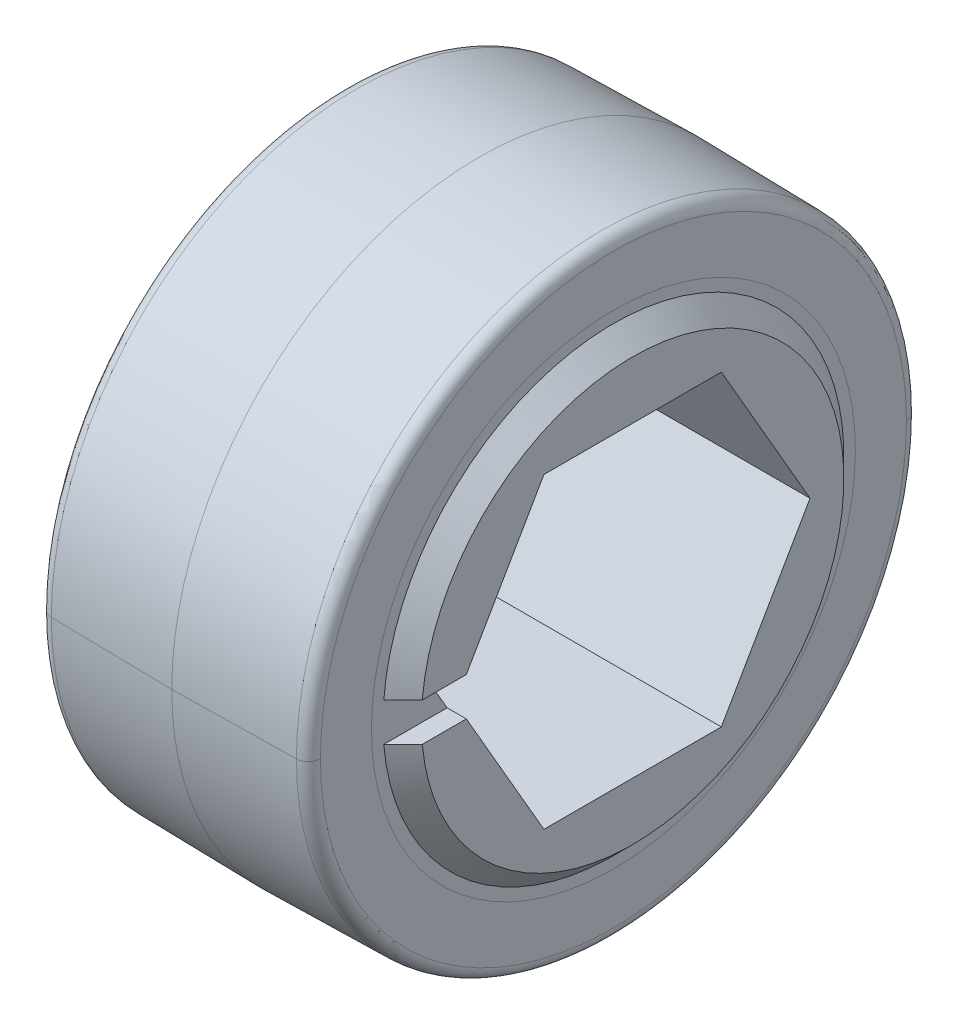
ISO-10303-21;
HEADER;
FILE_DESCRIPTION(('STEP AP214'),'2;1');
FILE_NAME('part.step','',(''),(''),'','','');
FILE_SCHEMA(('AUTOMOTIVE_DESIGN { 1 0 10303 214 1 1 1 1 }'));
ENDSEC;
DATA;
#1=APPLICATION_CONTEXT('core data for automotive mechanical design processes');
#2=APPLICATION_PROTOCOL_DEFINITION('international standard','automotive_design',2000,#1);
#3=PRODUCT_CONTEXT('',#1,'mechanical');
#4=PRODUCT('Part','Part','',(#3));
#5=PRODUCT_RELATED_PRODUCT_CATEGORY('part','',(#4));
#6=PRODUCT_DEFINITION_FORMATION('','',#4);
#7=PRODUCT_DEFINITION_CONTEXT('part definition',#1,'design');
#8=PRODUCT_DEFINITION('design','',#6,#7);
#9=PRODUCT_DEFINITION_SHAPE('','',#8);
#10=(LENGTH_UNIT() NAMED_UNIT(*) SI_UNIT(.MILLI.,.METRE.));
#11=(NAMED_UNIT(*) PLANE_ANGLE_UNIT() SI_UNIT($,.RADIAN.));
#12=(NAMED_UNIT(*) SI_UNIT($,.STERADIAN.) SOLID_ANGLE_UNIT());
#13=UNCERTAINTY_MEASURE_WITH_UNIT(LENGTH_MEASURE(1.E-05),#10,'distance_accuracy_value','');
#14=(GEOMETRIC_REPRESENTATION_CONTEXT(3) GLOBAL_UNCERTAINTY_ASSIGNED_CONTEXT((#13)) GLOBAL_UNIT_ASSIGNED_CONTEXT((#10,
#11,#12)) REPRESENTATION_CONTEXT('',''));
#15=CARTESIAN_POINT('',(0.,0.,0.));
#16=DIRECTION('',(0.,0.,1.));
#17=DIRECTION('',(1.,0.,0.));
#18=AXIS2_PLACEMENT_3D('',#15,#16,#17);
#19=CARTESIAN_POINT('',(-5.55625,0.,0.));
#20=DIRECTION('',(1.,0.,0.));
#21=DIRECTION('',(0.,1.,0.));
#22=AXIS2_PLACEMENT_3D('',#19,#20,#21);
#23=PLANE('',#22);
#24=CARTESIAN_POINT('',(-5.55625,0.,0.));
#25=DIRECTION('',(1.,0.,0.));
#26=DIRECTION('',(0.,0.,-1.));
#27=AXIS2_PLACEMENT_3D('',#24,#25,#26);
#28=CIRCLE('',#27,10.);
#29=CARTESIAN_POINT('',(-5.55625,0.,10.));
#30=VERTEX_POINT('',#29);
#31=CARTESIAN_POINT('',(-5.55625,0.,-10.));
#32=VERTEX_POINT('',#31);
#33=EDGE_CURVE('P0_E178',#30,#32,#28,.T.);
#34=ORIENTED_EDGE('',*,*,#33,.T.);
#35=CARTESIAN_POINT('',(-5.55625,0.,0.));
#36=DIRECTION('',(1.,0.,0.));
#37=DIRECTION('',(0.,0.,-1.));
#38=AXIS2_PLACEMENT_3D('',#35,#36,#37);
#39=CIRCLE('',#38,10.);
#40=EDGE_CURVE('P0_E37',#32,#30,#39,.T.);
#41=ORIENTED_EDGE('',*,*,#40,.T.);
#42=EDGE_LOOP('',(#34,#41));
#43=FACE_BOUND('',#42,.T.);
#44=CARTESIAN_POINT('',(-5.55625,0.,0.));
#45=DIRECTION('',(-1.,0.,0.));
#46=DIRECTION('',(0.,0.,-1.));
#47=AXIS2_PLACEMENT_3D('',#44,#45,#46);
#48=CIRCLE('',#47,12.1116666482116);
#49=CARTESIAN_POINT('',(-5.55625,0.,-12.1116666482116));
#50=VERTEX_POINT('',#49);
#51=CARTESIAN_POINT('',(-5.55625,0.,12.1116666482116));
#52=VERTEX_POINT('',#51);
#53=EDGE_CURVE('P0_E143',#50,#52,#48,.T.);
#54=ORIENTED_EDGE('',*,*,#53,.T.);
#55=CARTESIAN_POINT('',(-5.55625,0.,0.));
#56=DIRECTION('',(-1.,0.,0.));
#57=DIRECTION('',(0.,0.,-1.));
#58=AXIS2_PLACEMENT_3D('',#55,#56,#57);
#59=CIRCLE('',#58,12.1116666482116);
#60=EDGE_CURVE('P0_E140',#52,#50,#59,.T.);
#61=ORIENTED_EDGE('',*,*,#60,.T.);
#62=EDGE_LOOP('',(#54,#61));
#63=FACE_BOUND('',#62,.T.);
#64=ADVANCED_FACE('P0_F16',(#43,#63),#23,.F.);
#65=CARTESIAN_POINT('',(5.55625,0.,0.));
#66=DIRECTION('',(1.,0.,0.));
#67=DIRECTION('',(0.,1.,0.));
#68=AXIS2_PLACEMENT_3D('',#65,#66,#67);
#69=PLANE('',#68);
#70=CARTESIAN_POINT('',(5.55625,0.,0.));
#71=DIRECTION('',(1.,0.,0.));
#72=DIRECTION('',(0.,0.,-1.));
#73=AXIS2_PLACEMENT_3D('',#70,#71,#72);
#74=CIRCLE('',#73,10.);
#75=CARTESIAN_POINT('',(5.55625,0.,10.));
#76=VERTEX_POINT('',#75);
#77=CARTESIAN_POINT('',(5.55625,0.,-10.));
#78=VERTEX_POINT('',#77);
#79=EDGE_CURVE('P0_E173',#76,#78,#74,.T.);
#80=ORIENTED_EDGE('',*,*,#79,.F.);
#81=CARTESIAN_POINT('',(5.55625,0.,0.));
#82=DIRECTION('',(1.,0.,0.));
#83=DIRECTION('',(0.,0.,-1.));
#84=AXIS2_PLACEMENT_3D('',#81,#82,#83);
#85=CIRCLE('',#84,10.);
#86=EDGE_CURVE('P0_E135',#78,#76,#85,.T.);
#87=ORIENTED_EDGE('',*,*,#86,.F.);
#88=EDGE_LOOP('',(#80,#87));
#89=FACE_BOUND('',#88,.T.);
#90=CARTESIAN_POINT('',(5.55625,0.,0.));
#91=DIRECTION('',(1.,0.,0.));
#92=DIRECTION('',(0.,0.,-1.));
#93=AXIS2_PLACEMENT_3D('',#90,#91,#92);
#94=CIRCLE('',#93,12.1116666482116);
#95=CARTESIAN_POINT('',(5.55625,0.,-12.1116666482116));
#96=VERTEX_POINT('',#95);
#97=CARTESIAN_POINT('',(5.55625,0.,12.1116666482116));
#98=VERTEX_POINT('',#97);
#99=EDGE_CURVE('P0_E133',#96,#98,#94,.T.);
#100=ORIENTED_EDGE('',*,*,#99,.T.);
#101=CARTESIAN_POINT('',(5.55625,0.,0.));
#102=DIRECTION('',(1.,0.,0.));
#103=DIRECTION('',(0.,0.,-1.));
#104=AXIS2_PLACEMENT_3D('',#101,#102,#103);
#105=CIRCLE('',#104,12.1116666482116);
#106=EDGE_CURVE('P0_E26',#98,#96,#105,.T.);
#107=ORIENTED_EDGE('',*,*,#106,.T.);
#108=EDGE_LOOP('',(#100,#107));
#109=FACE_BOUND('',#108,.T.);
#110=ADVANCED_FACE('P0_F196',(#89,#109),#69,.T.);
#111=CARTESIAN_POINT('',(0.,0.,0.));
#112=DIRECTION('',(1.,0.,0.));
#113=DIRECTION('',(0.,0.,-1.));
#114=AXIS2_PLACEMENT_3D('',#111,#112,#113);
#115=CONICAL_SURFACE('',#114,12.7,0.0174532925199352);
#116=DIRECTION('',(0.999847695156391,0.,0.0174524064372769));
#117=VECTOR('',#116,1.);
#118=CARTESIAN_POINT('',(0.,0.,12.7));
#119=LINE('',#118,#117);
#120=CARTESIAN_POINT('',(-5.06497618749779,0.,12.6115905117874));
#121=VERTEX_POINT('',#120);
#122=CARTESIAN_POINT('',(0.,0.,12.7));
#123=VERTEX_POINT('',#122);
#124=EDGE_CURVE('P0_E94',#121,#123,#119,.T.);
#125=ORIENTED_EDGE('',*,*,#124,.F.);
#126=CARTESIAN_POINT('',(-5.06497618749779,0.,0.));
#127=DIRECTION('',(1.,0.,0.));
#128=DIRECTION('',(0.,0.,1.));
#129=AXIS2_PLACEMENT_3D('',#126,#127,#128);
#130=CIRCLE('',#129,12.6115905117874);
#131=CARTESIAN_POINT('',(-5.06497618749779,0.,-12.6115905117874));
#132=VERTEX_POINT('',#131);
#133=EDGE_CURVE('P0_E150',#121,#132,#130,.T.);
#134=ORIENTED_EDGE('',*,*,#133,.T.);
#135=DIRECTION('',(0.999847695156391,0.,-0.0174524064372769));
#136=VECTOR('',#135,1.);
#137=CARTESIAN_POINT('',(0.,0.,-12.7));
#138=LINE('',#137,#136);
#139=CARTESIAN_POINT('',(0.,0.,-12.7));
#140=VERTEX_POINT('',#139);
#141=EDGE_CURVE('P0_E97',#132,#140,#138,.T.);
#142=ORIENTED_EDGE('',*,*,#141,.T.);
#143=CARTESIAN_POINT('',(0.,0.,0.));
#144=DIRECTION('',(-1.,0.,0.));
#145=DIRECTION('',(0.,0.,1.));
#146=AXIS2_PLACEMENT_3D('',#143,#144,#145);
#147=CIRCLE('',#146,12.7);
#148=EDGE_CURVE('P0_E11',#140,#123,#147,.T.);
#149=ORIENTED_EDGE('',*,*,#148,.T.);
#150=EDGE_LOOP('',(#125,#134,#142,#149));
#151=FACE_BOUND('',#150,.T.);
#152=ADVANCED_FACE('P0_F92',(#151),#115,.T.);
#153=CARTESIAN_POINT('',(5.55625,0.,0.));
#154=DIRECTION('',(-1.,0.,0.));
#155=DIRECTION('',(0.,0.,1.));
#156=AXIS2_PLACEMENT_3D('',#153,#154,#155);
#157=CONICAL_SURFACE('',#156,12.6030152954926,0.0174532925199352);
#158=DIRECTION('',(-0.999847695156391,0.,-0.0174524064372772));
#159=VECTOR('',#158,1.);
#160=CARTESIAN_POINT('',(5.55625,0.,-12.6030152954926));
#161=LINE('',#160,#159);
#162=CARTESIAN_POINT('',(5.06497618749788,0.,-12.6115905117874));
#163=VERTEX_POINT('',#162);
#164=EDGE_CURVE('P0_E122',#163,#140,#161,.T.);
#165=ORIENTED_EDGE('',*,*,#164,.F.);
#166=CARTESIAN_POINT('',(5.06497618749788,0.,0.));
#167=DIRECTION('',(-1.,0.,0.));
#168=DIRECTION('',(0.,0.,1.));
#169=AXIS2_PLACEMENT_3D('',#166,#167,#168);
#170=CIRCLE('',#169,12.6115905117874);
#171=CARTESIAN_POINT('',(5.06497618749788,0.,12.6115905117874));
#172=VERTEX_POINT('',#171);
#173=EDGE_CURVE('P0_E115',#163,#172,#170,.T.);
#174=ORIENTED_EDGE('',*,*,#173,.T.);
#175=DIRECTION('',(-0.999847695156391,0.,0.0174524064372772));
#176=VECTOR('',#175,1.);
#177=CARTESIAN_POINT('',(5.55625,0.,12.6030152954926));
#178=LINE('',#177,#176);
#179=EDGE_CURVE('P0_E111',#172,#123,#178,.T.);
#180=ORIENTED_EDGE('',*,*,#179,.T.);
#181=ORIENTED_EDGE('',*,*,#148,.F.);
#182=EDGE_LOOP('',(#165,#174,#180,#181));
#183=FACE_BOUND('',#182,.T.);
#184=ADVANCED_FACE('P0_F114',(#183),#157,.T.);
#185=CARTESIAN_POINT('',(5.056249984,0.,0.));
#186=DIRECTION('',(1.,0.,0.));
#187=DIRECTION('',(0.,0.,-1.));
#188=AXIS2_PLACEMENT_3D('',#185,#186,#187);
#189=TOROIDAL_SURFACE('',#188,12.1116666482116,0.500000016);
#190=CARTESIAN_POINT('',(5.056249984,0.,12.1116666482116));
#191=DIRECTION('',(0.,1.,0.));
#192=DIRECTION('',(0.,0.,1.));
#193=AXIS2_PLACEMENT_3D('',#190,#191,#192);
#194=CIRCLE('',#193,0.500000016);
#195=EDGE_CURVE('P0_E167',#172,#98,#194,.T.);
#196=ORIENTED_EDGE('',*,*,#195,.F.);
#197=ORIENTED_EDGE('',*,*,#173,.F.);
#198=CARTESIAN_POINT('',(5.056249984,0.,-12.1116666482116));
#199=DIRECTION('',(0.,-1.,0.));
#200=DIRECTION('',(0.,0.,-1.));
#201=AXIS2_PLACEMENT_3D('',#198,#199,#200);
#202=CIRCLE('',#201,0.500000016);
#203=EDGE_CURVE('P0_E129',#163,#96,#202,.T.);
#204=ORIENTED_EDGE('',*,*,#203,.T.);
#205=ORIENTED_EDGE('',*,*,#106,.F.);
#206=EDGE_LOOP('',(#196,#197,#204,#205));
#207=FACE_BOUND('',#206,.T.);
#208=ADVANCED_FACE('P0_F18',(#207),#189,.T.);
#209=CARTESIAN_POINT('',(-5.056249984,0.,0.));
#210=DIRECTION('',(1.,0.,0.));
#211=DIRECTION('',(0.,0.,-1.));
#212=AXIS2_PLACEMENT_3D('',#209,#210,#211);
#213=TOROIDAL_SURFACE('',#212,12.1116666482116,0.500000016);
#214=CARTESIAN_POINT('',(-5.056249984,0.,12.1116666482116));
#215=DIRECTION('',(0.,1.,0.));
#216=DIRECTION('',(0.,0.,1.));
#217=AXIS2_PLACEMENT_3D('',#214,#215,#216);
#218=CIRCLE('',#217,0.500000016);
#219=EDGE_CURVE('P0_E138',#52,#121,#218,.T.);
#220=ORIENTED_EDGE('',*,*,#219,.F.);
#221=ORIENTED_EDGE('',*,*,#53,.F.);
#222=CARTESIAN_POINT('',(-5.056249984,0.,-12.1116666482116));
#223=DIRECTION('',(0.,-1.,0.));
#224=DIRECTION('',(0.,0.,-1.));
#225=AXIS2_PLACEMENT_3D('',#222,#223,#224);
#226=CIRCLE('',#225,0.500000016);
#227=EDGE_CURVE('P0_E163',#50,#132,#226,.T.);
#228=ORIENTED_EDGE('',*,*,#227,.T.);
#229=ORIENTED_EDGE('',*,*,#133,.F.);
#230=EDGE_LOOP('',(#220,#221,#228,#229));
#231=FACE_BOUND('',#230,.T.);
#232=ADVANCED_FACE('P0_F315',(#231),#213,.T.);
#233=CARTESIAN_POINT('',(6.36,0.,0.));
#234=DIRECTION('',(-1.,0.,0.));
#235=DIRECTION('',(0.,0.,1.));
#236=AXIS2_PLACEMENT_3D('',#233,#234,#235);
#237=CYLINDRICAL_SURFACE('',#236,10.);
#238=DIRECTION('',(-1.,0.,0.));
#239=VECTOR('',#238,1.);
#240=CARTESIAN_POINT('',(6.36,0.,-10.));
#241=LINE('',#240,#239);
#242=EDGE_CURVE('P0_E174',#78,#32,#241,.T.);
#243=ORIENTED_EDGE('',*,*,#242,.F.);
#244=ORIENTED_EDGE('',*,*,#86,.T.);
#245=DIRECTION('',(-1.,0.,0.));
#246=VECTOR('',#245,1.);
#247=CARTESIAN_POINT('',(6.36,0.,10.));
#248=LINE('',#247,#246);
#249=EDGE_CURVE('P0_E20',#76,#30,#248,.T.);
#250=ORIENTED_EDGE('',*,*,#249,.T.);
#251=ORIENTED_EDGE('',*,*,#40,.F.);
#252=EDGE_LOOP('',(#243,#244,#250,#251));
#253=FACE_BOUND('',#252,.T.);
#254=ADVANCED_FACE('P0_F191',(#253),#237,.F.);
#255=CARTESIAN_POINT('',(6.36,0.,0.));
#256=DIRECTION('',(-1.,0.,0.));
#257=DIRECTION('',(0.,0.,1.));
#258=AXIS2_PLACEMENT_3D('',#255,#256,#257);
#259=CYLINDRICAL_SURFACE('',#258,10.);
#260=ORIENTED_EDGE('',*,*,#79,.T.);
#261=ORIENTED_EDGE('',*,*,#242,.T.);
#262=ORIENTED_EDGE('',*,*,#33,.F.);
#263=ORIENTED_EDGE('',*,*,#249,.F.);
#264=EDGE_LOOP('',(#260,#261,#262,#263));
#265=FACE_BOUND('',#264,.T.);
#266=ADVANCED_FACE('P0_F194',(#265),#259,.F.);
#267=CARTESIAN_POINT('',(0.,0.,0.));
#268=DIRECTION('',(1.,0.,0.));
#269=DIRECTION('',(0.,0.,-1.));
#270=AXIS2_PLACEMENT_3D('',#267,#268,#269);
#271=CONICAL_SURFACE('',#270,12.7,0.0174532925199352);
#272=CARTESIAN_POINT('',(-5.06497618749779,0.,0.));
#273=DIRECTION('',(1.,0.,0.));
#274=DIRECTION('',(0.,0.,1.));
#275=AXIS2_PLACEMENT_3D('',#272,#273,#274);
#276=CIRCLE('',#275,12.6115905117874);
#277=EDGE_CURVE('P0_E108',#132,#121,#276,.T.);
#278=ORIENTED_EDGE('',*,*,#277,.T.);
#279=ORIENTED_EDGE('',*,*,#124,.T.);
#280=CARTESIAN_POINT('',(0.,0.,0.));
#281=DIRECTION('',(-1.,0.,0.));
#282=DIRECTION('',(0.,0.,1.));
#283=AXIS2_PLACEMENT_3D('',#280,#281,#282);
#284=CIRCLE('',#283,12.7);
#285=EDGE_CURVE('P0_E105',#123,#140,#284,.T.);
#286=ORIENTED_EDGE('',*,*,#285,.T.);
#287=ORIENTED_EDGE('',*,*,#141,.F.);
#288=EDGE_LOOP('',(#278,#279,#286,#287));
#289=FACE_BOUND('',#288,.T.);
#290=ADVANCED_FACE('P0_F103',(#289),#271,.T.);
#291=CARTESIAN_POINT('',(5.55625,0.,0.));
#292=DIRECTION('',(-1.,0.,0.));
#293=DIRECTION('',(0.,0.,1.));
#294=AXIS2_PLACEMENT_3D('',#291,#292,#293);
#295=CONICAL_SURFACE('',#294,12.6030152954926,0.0174532925199352);
#296=CARTESIAN_POINT('',(5.06497618749788,0.,0.));
#297=DIRECTION('',(-1.,0.,0.));
#298=DIRECTION('',(0.,0.,1.));
#299=AXIS2_PLACEMENT_3D('',#296,#297,#298);
#300=CIRCLE('',#299,12.6115905117874);
#301=EDGE_CURVE('P0_E164',#172,#163,#300,.T.);
#302=ORIENTED_EDGE('',*,*,#301,.T.);
#303=ORIENTED_EDGE('',*,*,#164,.T.);
#304=ORIENTED_EDGE('',*,*,#285,.F.);
#305=ORIENTED_EDGE('',*,*,#179,.F.);
#306=EDGE_LOOP('',(#302,#303,#304,#305));
#307=FACE_BOUND('',#306,.T.);
#308=ADVANCED_FACE('P0_F121',(#307),#295,.T.);
#309=CARTESIAN_POINT('',(5.056249984,0.,0.));
#310=DIRECTION('',(1.,0.,0.));
#311=DIRECTION('',(0.,0.,-1.));
#312=AXIS2_PLACEMENT_3D('',#309,#310,#311);
#313=TOROIDAL_SURFACE('',#312,12.1116666482116,0.500000016);
#314=ORIENTED_EDGE('',*,*,#301,.F.);
#315=ORIENTED_EDGE('',*,*,#195,.T.);
#316=ORIENTED_EDGE('',*,*,#99,.F.);
#317=ORIENTED_EDGE('',*,*,#203,.F.);
#318=EDGE_LOOP('',(#314,#315,#316,#317));
#319=FACE_BOUND('',#318,.T.);
#320=ADVANCED_FACE('P0_F204',(#319),#313,.T.);
#321=CARTESIAN_POINT('',(-5.056249984,0.,0.));
#322=DIRECTION('',(1.,0.,0.));
#323=DIRECTION('',(0.,0.,-1.));
#324=AXIS2_PLACEMENT_3D('',#321,#322,#323);
#325=TOROIDAL_SURFACE('',#324,12.1116666482116,0.500000016);
#326=ORIENTED_EDGE('',*,*,#60,.F.);
#327=ORIENTED_EDGE('',*,*,#219,.T.);
#328=ORIENTED_EDGE('',*,*,#277,.F.);
#329=ORIENTED_EDGE('',*,*,#227,.F.);
#330=EDGE_LOOP('',(#326,#327,#328,#329));
#331=FACE_BOUND('',#330,.T.);
#332=ADVANCED_FACE('P0_F303',(#331),#325,.T.);
#333=CLOSED_SHELL('',(#64,#110,#152,#184,#208,#232,#254,#266,#290,#308,#320,#332));
#334=MANIFOLD_SOLID_BREP('P0_B1',#333);
#335=CARTESIAN_POINT('',(6.36,0.,0.));
#336=DIRECTION('',(-1.,0.,0.));
#337=DIRECTION('',(0.,0.,1.));
#338=AXIS2_PLACEMENT_3D('',#335,#336,#337);
#339=CYLINDRICAL_SURFACE('',#338,10.);
#340=DIRECTION('',(-1.,0.,0.));
#341=VECTOR('',#340,1.);
#342=CARTESIAN_POINT('',(6.36,0.,-10.));
#343=LINE('',#342,#341);
#344=CARTESIAN_POINT('',(5.55625,0.,-10.));
#345=VERTEX_POINT('',#344);
#346=CARTESIAN_POINT('',(-5.55625,0.,-10.));
#347=VERTEX_POINT('',#346);
#348=EDGE_CURVE('P1_E211',#345,#347,#343,.T.);
#349=ORIENTED_EDGE('',*,*,#348,.F.);
#350=CARTESIAN_POINT('',(5.55625,0.,0.));
#351=DIRECTION('',(1.,0.,0.));
#352=DIRECTION('',(0.,0.,-1.));
#353=AXIS2_PLACEMENT_3D('',#350,#351,#352);
#354=CIRCLE('',#353,10.);
#355=CARTESIAN_POINT('',(5.55625,0.,10.));
#356=VERTEX_POINT('',#355);
#357=EDGE_CURVE('P1_E219',#356,#345,#354,.T.);
#358=ORIENTED_EDGE('',*,*,#357,.F.);
#359=DIRECTION('',(-1.,0.,0.));
#360=VECTOR('',#359,1.);
#361=CARTESIAN_POINT('',(6.36,0.,10.));
#362=LINE('',#361,#360);
#363=CARTESIAN_POINT('',(-5.55625,0.,10.));
#364=VERTEX_POINT('',#363);
#365=EDGE_CURVE('P1_E210',#356,#364,#362,.T.);
#366=ORIENTED_EDGE('',*,*,#365,.T.);
#367=CARTESIAN_POINT('',(-5.55625,0.,0.));
#368=DIRECTION('',(1.,0.,0.));
#369=DIRECTION('',(0.,0.,-1.));
#370=AXIS2_PLACEMENT_3D('',#367,#368,#369);
#371=CIRCLE('',#370,10.);
#372=EDGE_CURVE('P1_E11',#364,#347,#371,.T.);
#373=ORIENTED_EDGE('',*,*,#372,.T.);
#374=EDGE_LOOP('',(#349,#358,#366,#373));
#375=FACE_BOUND('',#374,.T.);
#376=ADVANCED_FACE('P1_F16',(#375),#339,.T.);
#377=CARTESIAN_POINT('',(-5.55625,0.,0.));
#378=DIRECTION('',(1.,0.,0.));
#379=DIRECTION('',(0.,1.,0.));
#380=AXIS2_PLACEMENT_3D('',#377,#378,#379);
#381=PLANE('',#380);
#382=DIRECTION('',(0.,0.,1.));
#383=VECTOR('',#382,1.);
#384=CARTESIAN_POINT('',(-5.55625,-0.79375,6.87407664253898));
#385=LINE('',#384,#383);
#386=CARTESIAN_POINT('',(-5.55625,-0.79375,6.87407664253898));
#387=VERTEX_POINT('',#386);
#388=CARTESIAN_POINT('',(-5.55625,-0.79375,9.49186946483674));
#389=VERTEX_POINT('',#388);
#390=EDGE_CURVE('P1_E27',#387,#389,#385,.T.);
#391=ORIENTED_EDGE('',*,*,#390,.T.);
#392=CARTESIAN_POINT('',(-5.55625,0.,0.));
#393=DIRECTION('',(1.,0.,0.));
#394=DIRECTION('',(0.,0.,-1.));
#395=AXIS2_PLACEMENT_3D('',#392,#393,#394);
#396=CIRCLE('',#395,9.525);
#397=CARTESIAN_POINT('',(-5.55625,0.,-9.525));
#398=VERTEX_POINT('',#397);
#399=EDGE_CURVE('P1_E252',#389,#398,#396,.T.);
#400=ORIENTED_EDGE('',*,*,#399,.T.);
#401=CARTESIAN_POINT('',(-5.55625,0.,0.));
#402=DIRECTION('',(1.,0.,0.));
#403=DIRECTION('',(0.,0.,-1.));
#404=AXIS2_PLACEMENT_3D('',#401,#402,#403);
#405=CIRCLE('',#404,9.525);
#406=CARTESIAN_POINT('',(-5.55625,0.79375,9.49186946483674));
#407=VERTEX_POINT('',#406);
#408=EDGE_CURVE('P1_E41',#398,#407,#405,.T.);
#409=ORIENTED_EDGE('',*,*,#408,.T.);
#410=DIRECTION('',(0.,0.,-1.));
#411=VECTOR('',#410,1.);
#412=CARTESIAN_POINT('',(-5.55625,0.79375,6.87407664253898));
#413=LINE('',#412,#411);
#414=CARTESIAN_POINT('',(-5.55625,0.79375,6.87407664253898));
#415=VERTEX_POINT('',#414);
#416=EDGE_CURVE('P1_E222',#407,#415,#413,.T.);
#417=ORIENTED_EDGE('',*,*,#416,.T.);
#418=DIRECTION('',(0.,0.866025403784439,-0.5));
#419=VECTOR('',#418,1.);
#420=CARTESIAN_POINT('',(-5.55625,0.,7.33234841870825));
#421=LINE('',#420,#419);
#422=CARTESIAN_POINT('',(-5.55625,0.,7.33234841870825));
#423=VERTEX_POINT('',#422);
#424=EDGE_CURVE('P1_E205',#423,#415,#421,.T.);
#425=ORIENTED_EDGE('',*,*,#424,.F.);
#426=DIRECTION('',(0.,0.866025403784439,0.5));
#427=VECTOR('',#426,1.);
#428=CARTESIAN_POINT('',(-5.55625,-6.35,3.66617420935412));
#429=LINE('',#428,#427);
#430=EDGE_CURVE('P1_E280',#387,#423,#429,.T.);
#431=ORIENTED_EDGE('',*,*,#430,.F.);
#432=EDGE_LOOP('',(#391,#400,#409,#417,#425,#431));
#433=FACE_BOUND('',#432,.T.);
#434=ORIENTED_EDGE('',*,*,#372,.F.);
#435=CARTESIAN_POINT('',(-5.55625,0.,0.));
#436=DIRECTION('',(1.,0.,0.));
#437=DIRECTION('',(0.,0.,-1.));
#438=AXIS2_PLACEMENT_3D('',#435,#436,#437);
#439=CIRCLE('',#438,10.);
#440=EDGE_CURVE('P1_E206',#347,#364,#439,.T.);
#441=ORIENTED_EDGE('',*,*,#440,.F.);
#442=EDGE_LOOP('',(#434,#441));
#443=FACE_BOUND('',#442,.T.);
#444=ADVANCED_FACE('P1_F511',(#433,#443),#381,.F.);
#445=CARTESIAN_POINT('',(-2.46633885287417,-0.79375,6.87407664253898));
#446=DIRECTION('',(0.,-1.,0.));
#447=DIRECTION('',(0.,0.,-1.));
#448=AXIS2_PLACEMENT_3D('',#445,#446,#447);
#449=PLANE('',#448);
#450=ORIENTED_EDGE('',*,*,#390,.F.);
#451=DIRECTION('',(-1.,0.,0.));
#452=VECTOR('',#451,1.);
#453=CARTESIAN_POINT('',(-2.46633885287417,-0.79375,6.87407664253898));
#454=LINE('',#453,#452);
#455=CARTESIAN_POINT('',(-6.35,-0.79375,6.87407664253898));
#456=VERTEX_POINT('',#455);
#457=EDGE_CURVE('P1_E236',#387,#456,#454,.T.);
#458=ORIENTED_EDGE('',*,*,#457,.T.);
#459=DIRECTION('',(0.,0.,1.));
#460=VECTOR('',#459,1.);
#461=CARTESIAN_POINT('',(-6.35,-0.79375,6.87407664253898));
#462=LINE('',#461,#460);
#463=CARTESIAN_POINT('',(-6.35,-0.79375,8.69509560039451));
#464=VERTEX_POINT('',#463);
#465=EDGE_CURVE('P1_E199',#456,#464,#462,.T.);
#466=ORIENTED_EDGE('',*,*,#465,.T.);
#467=CARTESIAN_POINT('',(-5.55625,-0.79375,9.49186946483674));
#468=CARTESIAN_POINT('',(-5.82087557566039,-0.79375,9.2263202368893));
#469=CARTESIAN_POINT('',(-6.08546276446943,-0.79375,8.96073278759479));
#470=CARTESIAN_POINT('',(-6.35,-0.79375,8.69509560039451));
#471=(BOUNDED_CURVE() B_SPLINE_CURVE(3,(#467,#468,#469,#470),.UNSPECIFIED.,.F.,
.F.) B_SPLINE_CURVE_WITH_KNOTS((4,4),(0.00391899332069771,0.00504366552563672),
.UNSPECIFIED.) CURVE() GEOMETRIC_REPRESENTATION_ITEM() RATIONAL_B_SPLINE_CURVE((1.,1.,1.,1.)) REPRESENTATION_ITEM(''));
#472=EDGE_CURVE('P1_E240',#389,#464,#471,.T.);
#473=ORIENTED_EDGE('',*,*,#472,.F.);
#474=EDGE_LOOP('',(#450,#458,#466,#473));
#475=FACE_BOUND('',#474,.T.);
#476=ADVANCED_FACE('P1_F327',(#475),#449,.F.);
#477=CARTESIAN_POINT('',(-5.55625,0.,0.));
#478=DIRECTION('',(1.,0.,0.));
#479=DIRECTION('',(0.,0.,-1.));
#480=AXIS2_PLACEMENT_3D('',#477,#478,#479);
#481=CONICAL_SURFACE('',#480,9.525,0.785398163397455);
#482=DIRECTION('',(0.707106781186543,0.,-0.707106781186552));
#483=VECTOR('',#482,1.);
#484=CARTESIAN_POINT('',(-5.55625,0.,-9.525));
#485=LINE('',#484,#483);
#486=CARTESIAN_POINT('',(-6.35,0.,-8.73125));
#487=VERTEX_POINT('',#486);
#488=EDGE_CURVE('P1_E308',#487,#398,#485,.T.);
#489=ORIENTED_EDGE('',*,*,#488,.F.);
#490=CARTESIAN_POINT('',(-6.35,0.,0.));
#491=DIRECTION('',(-1.,0.,0.));
#492=DIRECTION('',(0.,0.,1.));
#493=AXIS2_PLACEMENT_3D('',#490,#491,#492);
#494=CIRCLE('',#493,8.73125);
#495=CARTESIAN_POINT('',(-6.35,0.79375,8.69509560039451));
#496=VERTEX_POINT('',#495);
#497=EDGE_CURVE('P1_E216',#496,#487,#494,.T.);
#498=ORIENTED_EDGE('',*,*,#497,.F.);
#499=CARTESIAN_POINT('',(-6.35,0.79375,8.69509560039451));
#500=CARTESIAN_POINT('',(-6.08546277724763,0.79375,8.96073277476345));
#501=CARTESIAN_POINT('',(-5.82087558737378,0.79375,9.22632022513503));
#502=CARTESIAN_POINT('',(-5.55625,0.79375,9.49186946483674));
#503=(BOUNDED_CURVE() B_SPLINE_CURVE(3,(#499,#500,#501,#502),.UNSPECIFIED.,.F.,
.F.) B_SPLINE_CURVE_WITH_KNOTS((4,4),(0.00392567411767077,0.0050503461978759),
.UNSPECIFIED.) CURVE() GEOMETRIC_REPRESENTATION_ITEM() RATIONAL_B_SPLINE_CURVE((1.,1.,1.,1.)) REPRESENTATION_ITEM(''));
#504=EDGE_CURVE('P1_E261',#496,#407,#503,.T.);
#505=ORIENTED_EDGE('',*,*,#504,.T.);
#506=ORIENTED_EDGE('',*,*,#408,.F.);
#507=EDGE_LOOP('',(#489,#498,#505,#506));
#508=FACE_BOUND('',#507,.T.);
#509=ADVANCED_FACE('P1_F534',(#508),#481,.T.);
#510=CARTESIAN_POINT('',(-2.46633885287417,0.79375,6.87407664253898));
#511=DIRECTION('',(0.,1.,0.));
#512=DIRECTION('',(1.,0.,0.));
#513=AXIS2_PLACEMENT_3D('',#510,#511,#512);
#514=PLANE('',#513);
#515=DIRECTION('',(0.,0.,-1.));
#516=VECTOR('',#515,1.);
#517=CARTESIAN_POINT('',(-6.35,0.79375,6.87407664253898));
#518=LINE('',#517,#516);
#519=CARTESIAN_POINT('',(-6.35,0.79375,6.87407664253898));
#520=VERTEX_POINT('',#519);
#521=EDGE_CURVE('P1_E212',#496,#520,#518,.T.);
#522=ORIENTED_EDGE('',*,*,#521,.T.);
#523=DIRECTION('',(-1.,0.,0.));
#524=VECTOR('',#523,1.);
#525=CARTESIAN_POINT('',(-2.46633885287417,0.79375,6.87407664253898));
#526=LINE('',#525,#524);
#527=EDGE_CURVE('P1_E201',#415,#520,#526,.T.);
#528=ORIENTED_EDGE('',*,*,#527,.F.);
#529=ORIENTED_EDGE('',*,*,#416,.F.);
#530=ORIENTED_EDGE('',*,*,#504,.F.);
#531=EDGE_LOOP('',(#522,#528,#529,#530));
#532=FACE_BOUND('',#531,.T.);
#533=ADVANCED_FACE('P1_F524',(#532),#514,.F.);
#534=CARTESIAN_POINT('',(5.55625,0.,0.));
#535=DIRECTION('',(1.,0.,0.));
#536=DIRECTION('',(0.,1.,0.));
#537=AXIS2_PLACEMENT_3D('',#534,#535,#536);
#538=PLANE('',#537);
#539=CARTESIAN_POINT('',(5.55625,0.,0.));
#540=DIRECTION('',(-1.,0.,0.));
#541=DIRECTION('',(0.,0.,-1.));
#542=AXIS2_PLACEMENT_3D('',#539,#540,#541);
#543=CIRCLE('',#542,9.525);
#544=CARTESIAN_POINT('',(5.55625,0.79375,9.49186946483673));
#545=VERTEX_POINT('',#544);
#546=CARTESIAN_POINT('',(5.55625,-0.79375,9.49186946483673));
#547=VERTEX_POINT('',#546);
#548=EDGE_CURVE('P1_E159',#545,#547,#543,.T.);
#549=ORIENTED_EDGE('',*,*,#548,.T.);
#550=DIRECTION('',(0.,0.,1.));
#551=VECTOR('',#550,1.);
#552=CARTESIAN_POINT('',(5.55625,-0.79375,6.87407664253898));
#553=LINE('',#552,#551);
#554=CARTESIAN_POINT('',(5.55625,-0.79375,6.87407664253898));
#555=VERTEX_POINT('',#554);
#556=EDGE_CURVE('P1_E341',#555,#547,#553,.T.);
#557=ORIENTED_EDGE('',*,*,#556,.F.);
#558=DIRECTION('',(0.,0.866025403784439,0.5));
#559=VECTOR('',#558,1.);
#560=CARTESIAN_POINT('',(5.55625,-6.35,3.66617420935412));
#561=LINE('',#560,#559);
#562=CARTESIAN_POINT('',(5.55625,0.,7.33234841870825));
#563=VERTEX_POINT('',#562);
#564=EDGE_CURVE('P1_E204',#555,#563,#561,.T.);
#565=ORIENTED_EDGE('',*,*,#564,.T.);
#566=DIRECTION('',(0.,0.866025403784439,-0.5));
#567=VECTOR('',#566,1.);
#568=CARTESIAN_POINT('',(5.55625,0.,7.33234841870825));
#569=LINE('',#568,#567);
#570=CARTESIAN_POINT('',(5.55625,0.79375,6.87407664253898));
#571=VERTEX_POINT('',#570);
#572=EDGE_CURVE('P1_E164',#563,#571,#569,.T.);
#573=ORIENTED_EDGE('',*,*,#572,.T.);
#574=DIRECTION('',(0.,0.,-1.));
#575=VECTOR('',#574,1.);
#576=CARTESIAN_POINT('',(5.55625,0.79375,6.87407664253898));
#577=LINE('',#576,#575);
#578=EDGE_CURVE('P1_E194',#545,#571,#577,.T.);
#579=ORIENTED_EDGE('',*,*,#578,.F.);
#580=EDGE_LOOP('',(#549,#557,#565,#573,#579));
#581=FACE_BOUND('',#580,.T.);
#582=ORIENTED_EDGE('',*,*,#357,.T.);
#583=CARTESIAN_POINT('',(5.55625,0.,0.));
#584=DIRECTION('',(1.,0.,0.));
#585=DIRECTION('',(0.,0.,-1.));
#586=AXIS2_PLACEMENT_3D('',#583,#584,#585);
#587=CIRCLE('',#586,10.);
#588=EDGE_CURVE('P1_E237',#345,#356,#587,.T.);
#589=ORIENTED_EDGE('',*,*,#588,.T.);
#590=EDGE_LOOP('',(#582,#589));
#591=FACE_BOUND('',#590,.T.);
#592=ADVANCED_FACE('P1_F519',(#581,#591),#538,.T.);
#593=CARTESIAN_POINT('',(6.35,0.,0.));
#594=DIRECTION('',(-1.,0.,0.));
#595=DIRECTION('',(0.,0.,1.));
#596=AXIS2_PLACEMENT_3D('',#593,#594,#595);
#597=CONICAL_SURFACE('',#596,8.73125,0.785398163397446);
#598=CARTESIAN_POINT('',(6.35,0.,0.));
#599=DIRECTION('',(-1.,0.,0.));
#600=DIRECTION('',(0.,0.,1.));
#601=AXIS2_PLACEMENT_3D('',#598,#599,#600);
#602=CIRCLE('',#601,8.73125);
#603=CARTESIAN_POINT('',(6.35,0.79375,8.69509560039451));
#604=VERTEX_POINT('',#603);
#605=CARTESIAN_POINT('',(6.35,-0.79375,8.69509560039451));
#606=VERTEX_POINT('',#605);
#607=EDGE_CURVE('P1_E157',#604,#606,#602,.T.);
#608=ORIENTED_EDGE('',*,*,#607,.T.);
#609=CARTESIAN_POINT('',(6.35,-0.79375,8.69509560039451));
#610=CARTESIAN_POINT('',(6.08546277724763,-0.79375,8.96073277476344));
#611=CARTESIAN_POINT('',(5.82087558737378,-0.79375,9.22632022513502));
#612=CARTESIAN_POINT('',(5.55625,-0.79375,9.49186946483673));
#613=(BOUNDED_CURVE() B_SPLINE_CURVE(3,(#609,#610,#611,#612),.UNSPECIFIED.,.F.,
.F.) B_SPLINE_CURVE_WITH_KNOTS((4,4),(0.00392567411767071,0.00505034619787583),
.UNSPECIFIED.) CURVE() GEOMETRIC_REPRESENTATION_ITEM() RATIONAL_B_SPLINE_CURVE((1.,1.,1.,1.)) REPRESENTATION_ITEM(''));
#614=EDGE_CURVE('P1_E220',#606,#547,#613,.T.);
#615=ORIENTED_EDGE('',*,*,#614,.T.);
#616=ORIENTED_EDGE('',*,*,#548,.F.);
#617=CARTESIAN_POINT('',(5.55625,0.79375,9.49186946483673));
#618=CARTESIAN_POINT('',(5.82087557566039,0.79375,9.22632023688929));
#619=CARTESIAN_POINT('',(6.08546276446943,0.79375,8.96073278759478));
#620=CARTESIAN_POINT('',(6.35,0.79375,8.69509560039451));
#621=(BOUNDED_CURVE() B_SPLINE_CURVE(3,(#617,#618,#619,#620),.UNSPECIFIED.,.F.,
.F.) B_SPLINE_CURVE_WITH_KNOTS((4,4),(0.00391899332069766,0.00504366552563666),
.UNSPECIFIED.) CURVE() GEOMETRIC_REPRESENTATION_ITEM() RATIONAL_B_SPLINE_CURVE((1.,1.,1.,1.)) REPRESENTATION_ITEM(''));
#622=EDGE_CURVE('P1_E152',#545,#604,#621,.T.);
#623=ORIENTED_EDGE('',*,*,#622,.T.);
#624=EDGE_LOOP('',(#608,#615,#616,#623));
#625=FACE_BOUND('',#624,.T.);
#626=ADVANCED_FACE('P1_F154',(#625),#597,.T.);
#627=CARTESIAN_POINT('',(2.46633885287419,-0.79375,6.87407664253898));
#628=DIRECTION('',(0.,-1.,0.));
#629=DIRECTION('',(0.,0.,-1.));
#630=AXIS2_PLACEMENT_3D('',#627,#628,#629);
#631=PLANE('',#630);
#632=DIRECTION('',(0.,0.,-1.));
#633=VECTOR('',#632,1.);
#634=CARTESIAN_POINT('',(6.35,-0.79375,6.87407664253898));
#635=LINE('',#634,#633);
#636=CARTESIAN_POINT('',(6.35,-0.79375,6.87407664253898));
#637=VERTEX_POINT('',#636);
#638=EDGE_CURVE('P1_E178',#606,#637,#635,.T.);
#639=ORIENTED_EDGE('',*,*,#638,.T.);
#640=DIRECTION('',(1.,0.,0.));
#641=VECTOR('',#640,1.);
#642=CARTESIAN_POINT('',(2.46633885287419,-0.79375,6.87407664253898));
#643=LINE('',#642,#641);
#644=EDGE_CURVE('P1_E232',#555,#637,#643,.T.);
#645=ORIENTED_EDGE('',*,*,#644,.F.);
#646=ORIENTED_EDGE('',*,*,#556,.T.);
#647=ORIENTED_EDGE('',*,*,#614,.F.);
#648=EDGE_LOOP('',(#639,#645,#646,#647));
#649=FACE_BOUND('',#648,.T.);
#650=ADVANCED_FACE('P1_F576',(#649),#631,.F.);
#651=CARTESIAN_POINT('',(6.35,-6.35,3.66617420935412));
#652=DIRECTION('',(0.,-0.5,0.866025403784439));
#653=DIRECTION('',(-1.,0.,0.));
#654=AXIS2_PLACEMENT_3D('',#651,#652,#653);
#655=PLANE('',#654);
#656=ORIENTED_EDGE('',*,*,#564,.F.);
#657=ORIENTED_EDGE('',*,*,#644,.T.);
#658=DIRECTION('',(0.,0.866025403784439,0.5));
#659=VECTOR('',#658,1.);
#660=CARTESIAN_POINT('',(6.35,-6.35,3.66617420935412));
#661=LINE('',#660,#659);
#662=CARTESIAN_POINT('',(6.35,-6.35,3.66617420935412));
#663=VERTEX_POINT('',#662);
#664=EDGE_CURVE('P1_E186',#663,#637,#661,.T.);
#665=ORIENTED_EDGE('',*,*,#664,.F.);
#666=DIRECTION('',(-1.,0.,0.));
#667=VECTOR('',#666,1.);
#668=CARTESIAN_POINT('',(6.35,-6.35,3.66617420935412));
#669=LINE('',#668,#667);
#670=CARTESIAN_POINT('',(-6.35,-6.35,3.66617420935412));
#671=VERTEX_POINT('',#670);
#672=EDGE_CURVE('P1_E340',#663,#671,#669,.T.);
#673=ORIENTED_EDGE('',*,*,#672,.T.);
#674=DIRECTION('',(0.,0.866025403784439,0.5));
#675=VECTOR('',#674,1.);
#676=CARTESIAN_POINT('',(-6.35,-6.35,3.66617420935412));
#677=LINE('',#676,#675);
#678=EDGE_CURVE('P1_E288',#671,#456,#677,.T.);
#679=ORIENTED_EDGE('',*,*,#678,.T.);
#680=ORIENTED_EDGE('',*,*,#457,.F.);
#681=ORIENTED_EDGE('',*,*,#430,.T.);
#682=DIRECTION('',(-1.,0.,0.));
#683=VECTOR('',#682,1.);
#684=CARTESIAN_POINT('',(6.35,0.,7.33234841870825));
#685=LINE('',#684,#683);
#686=EDGE_CURVE('P1_E20',#563,#423,#685,.T.);
#687=ORIENTED_EDGE('',*,*,#686,.F.);
#688=EDGE_LOOP('',(#656,#657,#665,#673,#679,#680,#681,#687));
#689=FACE_BOUND('',#688,.T.);
#690=ADVANCED_FACE('P1_F385',(#689),#655,.F.);
#691=CARTESIAN_POINT('',(6.35,0.,7.33234841870825));
#692=DIRECTION('',(0.,0.5,0.866025403784439));
#693=DIRECTION('',(1.,0.,0.));
#694=AXIS2_PLACEMENT_3D('',#691,#692,#693);
#695=PLANE('',#694);
#696=DIRECTION('',(0.,0.866025403784439,-0.5));
#697=VECTOR('',#696,1.);
#698=CARTESIAN_POINT('',(6.35,0.,7.33234841870825));
#699=LINE('',#698,#697);
#700=CARTESIAN_POINT('',(6.35,0.79375,6.87407664253898));
#701=VERTEX_POINT('',#700);
#702=CARTESIAN_POINT('',(6.35,6.35,3.66617420935412));
#703=VERTEX_POINT('',#702);
#704=EDGE_CURVE('P1_E174',#701,#703,#699,.T.);
#705=ORIENTED_EDGE('',*,*,#704,.F.);
#706=DIRECTION('',(1.,0.,0.));
#707=VECTOR('',#706,1.);
#708=CARTESIAN_POINT('',(2.46633885287419,0.79375,6.87407664253898));
#709=LINE('',#708,#707);
#710=EDGE_CURVE('P1_E165',#571,#701,#709,.T.);
#711=ORIENTED_EDGE('',*,*,#710,.F.);
#712=ORIENTED_EDGE('',*,*,#572,.F.);
#713=ORIENTED_EDGE('',*,*,#686,.T.);
#714=ORIENTED_EDGE('',*,*,#424,.T.);
#715=ORIENTED_EDGE('',*,*,#527,.T.);
#716=DIRECTION('',(0.,0.866025403784439,-0.5));
#717=VECTOR('',#716,1.);
#718=CARTESIAN_POINT('',(-6.35,0.,7.33234841870825));
#719=LINE('',#718,#717);
#720=CARTESIAN_POINT('',(-6.35,6.35,3.66617420935412));
#721=VERTEX_POINT('',#720);
#722=EDGE_CURVE('P1_E217',#520,#721,#719,.T.);
#723=ORIENTED_EDGE('',*,*,#722,.T.);
#724=DIRECTION('',(-1.,0.,0.));
#725=VECTOR('',#724,1.);
#726=CARTESIAN_POINT('',(6.35,6.35,3.66617420935412));
#727=LINE('',#726,#725);
#728=EDGE_CURVE('P1_E195',#703,#721,#727,.T.);
#729=ORIENTED_EDGE('',*,*,#728,.F.);
#730=EDGE_LOOP('',(#705,#711,#712,#713,#714,#715,#723,#729));
#731=FACE_BOUND('',#730,.T.);
#732=ADVANCED_FACE('P1_F575',(#731),#695,.F.);
#733=CARTESIAN_POINT('',(2.46633885287419,0.79375,6.87407664253898));
#734=DIRECTION('',(0.,1.,0.));
#735=DIRECTION('',(0.,0.,-1.));
#736=AXIS2_PLACEMENT_3D('',#733,#734,#735);
#737=PLANE('',#736);
#738=ORIENTED_EDGE('',*,*,#578,.T.);
#739=ORIENTED_EDGE('',*,*,#710,.T.);
#740=DIRECTION('',(0.,0.,1.));
#741=VECTOR('',#740,1.);
#742=CARTESIAN_POINT('',(6.35,0.79375,6.87407664253898));
#743=LINE('',#742,#741);
#744=EDGE_CURVE('P1_E168',#701,#604,#743,.T.);
#745=ORIENTED_EDGE('',*,*,#744,.T.);
#746=ORIENTED_EDGE('',*,*,#622,.F.);
#747=EDGE_LOOP('',(#738,#739,#745,#746));
#748=FACE_BOUND('',#747,.T.);
#749=ADVANCED_FACE('P1_F169',(#748),#737,.F.);
#750=CARTESIAN_POINT('',(6.35,0.,0.));
#751=DIRECTION('',(-1.,0.,0.));
#752=DIRECTION('',(0.,0.,1.));
#753=AXIS2_PLACEMENT_3D('',#750,#751,#752);
#754=PLANE('',#753);
#755=ORIENTED_EDGE('',*,*,#664,.T.);
#756=ORIENTED_EDGE('',*,*,#638,.F.);
#757=ORIENTED_EDGE('',*,*,#607,.F.);
#758=ORIENTED_EDGE('',*,*,#744,.F.);
#759=ORIENTED_EDGE('',*,*,#704,.T.);
#760=DIRECTION('',(0.,0.,-1.));
#761=VECTOR('',#760,1.);
#762=CARTESIAN_POINT('',(6.35,6.35,3.66617420935412));
#763=LINE('',#762,#761);
#764=CARTESIAN_POINT('',(6.35,6.35,-3.66617420935412));
#765=VERTEX_POINT('',#764);
#766=EDGE_CURVE('P1_E200',#703,#765,#763,.T.);
#767=ORIENTED_EDGE('',*,*,#766,.T.);
#768=DIRECTION('',(0.,-0.866025403784439,-0.5));
#769=VECTOR('',#768,1.);
#770=CARTESIAN_POINT('',(6.35,6.35,-3.66617420935412));
#771=LINE('',#770,#769);
#772=CARTESIAN_POINT('',(6.35,0.,-7.33234841870825));
#773=VERTEX_POINT('',#772);
#774=EDGE_CURVE('P1_E242',#765,#773,#771,.T.);
#775=ORIENTED_EDGE('',*,*,#774,.T.);
#776=DIRECTION('',(0.,-0.866025403784439,0.5));
#777=VECTOR('',#776,1.);
#778=CARTESIAN_POINT('',(6.35,0.,-7.33234841870825));
#779=LINE('',#778,#777);
#780=CARTESIAN_POINT('',(6.35,-6.35,-3.66617420935412));
#781=VERTEX_POINT('',#780);
#782=EDGE_CURVE('P1_E231',#773,#781,#779,.T.);
#783=ORIENTED_EDGE('',*,*,#782,.T.);
#784=DIRECTION('',(0.,0.,1.));
#785=VECTOR('',#784,1.);
#786=CARTESIAN_POINT('',(6.35,-6.35,-3.66617420935412));
#787=LINE('',#786,#785);
#788=EDGE_CURVE('P1_E190',#781,#663,#787,.T.);
#789=ORIENTED_EDGE('',*,*,#788,.T.);
#790=EDGE_LOOP('',(#755,#756,#757,#758,#759,#767,#775,#783,#789));
#791=FACE_BOUND('',#790,.T.);
#792=ADVANCED_FACE('P1_F18',(#791),#754,.F.);
#793=CARTESIAN_POINT('',(6.35,-6.35,-3.66617420935412));
#794=DIRECTION('',(0.,-1.,0.));
#795=DIRECTION('',(-1.,0.,0.));
#796=AXIS2_PLACEMENT_3D('',#793,#794,#795);
#797=PLANE('',#796);
#798=DIRECTION('',(0.,0.,1.));
#799=VECTOR('',#798,1.);
#800=CARTESIAN_POINT('',(-6.35,-6.35,-3.66617420935412));
#801=LINE('',#800,#799);
#802=CARTESIAN_POINT('',(-6.35,-6.35,-3.66617420935412));
#803=VERTEX_POINT('',#802);
#804=EDGE_CURVE('P1_E281',#803,#671,#801,.T.);
#805=ORIENTED_EDGE('',*,*,#804,.T.);
#806=ORIENTED_EDGE('',*,*,#672,.F.);
#807=ORIENTED_EDGE('',*,*,#788,.F.);
#808=DIRECTION('',(-1.,0.,0.));
#809=VECTOR('',#808,1.);
#810=CARTESIAN_POINT('',(6.35,-6.35,-3.66617420935412));
#811=LINE('',#810,#809);
#812=EDGE_CURVE('P1_E227',#781,#803,#811,.T.);
#813=ORIENTED_EDGE('',*,*,#812,.T.);
#814=EDGE_LOOP('',(#805,#806,#807,#813));
#815=FACE_BOUND('',#814,.T.);
#816=ADVANCED_FACE('P1_F382',(#815),#797,.F.);
#817=CARTESIAN_POINT('',(-6.35,0.,0.));
#818=DIRECTION('',(-1.,0.,0.));
#819=DIRECTION('',(0.,0.,1.));
#820=AXIS2_PLACEMENT_3D('',#817,#818,#819);
#821=PLANE('',#820);
#822=ORIENTED_EDGE('',*,*,#465,.F.);
#823=ORIENTED_EDGE('',*,*,#678,.F.);
#824=ORIENTED_EDGE('',*,*,#804,.F.);
#825=DIRECTION('',(0.,-0.866025403784439,0.5));
#826=VECTOR('',#825,1.);
#827=CARTESIAN_POINT('',(-6.35,0.,-7.33234841870825));
#828=LINE('',#827,#826);
#829=CARTESIAN_POINT('',(-6.35,0.,-7.33234841870825));
#830=VERTEX_POINT('',#829);
#831=EDGE_CURVE('P1_E226',#830,#803,#828,.T.);
#832=ORIENTED_EDGE('',*,*,#831,.F.);
#833=DIRECTION('',(0.,-0.866025403784439,-0.5));
#834=VECTOR('',#833,1.);
#835=CARTESIAN_POINT('',(-6.35,6.35,-3.66617420935412));
#836=LINE('',#835,#834);
#837=CARTESIAN_POINT('',(-6.35,6.35,-3.66617420935412));
#838=VERTEX_POINT('',#837);
#839=EDGE_CURVE('P1_E246',#838,#830,#836,.T.);
#840=ORIENTED_EDGE('',*,*,#839,.F.);
#841=DIRECTION('',(0.,0.,-1.));
#842=VECTOR('',#841,1.);
#843=CARTESIAN_POINT('',(-6.35,6.35,3.66617420935412));
#844=LINE('',#843,#842);
#845=EDGE_CURVE('P1_E292',#721,#838,#844,.T.);
#846=ORIENTED_EDGE('',*,*,#845,.F.);
#847=ORIENTED_EDGE('',*,*,#722,.F.);
#848=ORIENTED_EDGE('',*,*,#521,.F.);
#849=ORIENTED_EDGE('',*,*,#497,.T.);
#850=CARTESIAN_POINT('',(-6.35,0.,0.));
#851=DIRECTION('',(-1.,0.,0.));
#852=DIRECTION('',(0.,0.,1.));
#853=AXIS2_PLACEMENT_3D('',#850,#851,#852);
#854=CIRCLE('',#853,8.73125);
#855=EDGE_CURVE('P1_E311',#487,#464,#854,.T.);
#856=ORIENTED_EDGE('',*,*,#855,.T.);
#857=EDGE_LOOP('',(#822,#823,#824,#832,#840,#846,#847,#848,#849,#856));
#858=FACE_BOUND('',#857,.T.);
#859=ADVANCED_FACE('P1_F318',(#858),#821,.T.);
#860=CARTESIAN_POINT('',(6.35,6.35,3.66617420935412));
#861=DIRECTION('',(0.,1.,0.));
#862=DIRECTION('',(1.,0.,0.));
#863=AXIS2_PLACEMENT_3D('',#860,#861,#862);
#864=PLANE('',#863);
#865=ORIENTED_EDGE('',*,*,#845,.T.);
#866=DIRECTION('',(-1.,0.,0.));
#867=VECTOR('',#866,1.);
#868=CARTESIAN_POINT('',(6.35,6.35,-3.66617420935412));
#869=LINE('',#868,#867);
#870=EDGE_CURVE('P1_E245',#765,#838,#869,.T.);
#871=ORIENTED_EDGE('',*,*,#870,.F.);
#872=ORIENTED_EDGE('',*,*,#766,.F.);
#873=ORIENTED_EDGE('',*,*,#728,.T.);
#874=EDGE_LOOP('',(#865,#871,#872,#873));
#875=FACE_BOUND('',#874,.T.);
#876=ADVANCED_FACE('P1_F552',(#875),#864,.F.);
#877=CARTESIAN_POINT('',(6.35,6.35,-3.66617420935412));
#878=DIRECTION('',(0.,0.5,-0.866025403784439));
#879=DIRECTION('',(-1.,0.,0.));
#880=AXIS2_PLACEMENT_3D('',#877,#878,#879);
#881=PLANE('',#880);
#882=ORIENTED_EDGE('',*,*,#839,.T.);
#883=DIRECTION('',(-1.,0.,0.));
#884=VECTOR('',#883,1.);
#885=CARTESIAN_POINT('',(6.35,0.,-7.33234841870825));
#886=LINE('',#885,#884);
#887=EDGE_CURVE('P1_E302',#773,#830,#886,.T.);
#888=ORIENTED_EDGE('',*,*,#887,.F.);
#889=ORIENTED_EDGE('',*,*,#774,.F.);
#890=ORIENTED_EDGE('',*,*,#870,.T.);
#891=EDGE_LOOP('',(#882,#888,#889,#890));
#892=FACE_BOUND('',#891,.T.);
#893=ADVANCED_FACE('P1_F546',(#892),#881,.F.);
#894=CARTESIAN_POINT('',(6.35,0.,-7.33234841870825));
#895=DIRECTION('',(0.,-0.5,-0.866025403784439));
#896=DIRECTION('',(0.,-0.866025403784439,0.5));
#897=AXIS2_PLACEMENT_3D('',#894,#895,#896);
#898=PLANE('',#897);
#899=ORIENTED_EDGE('',*,*,#831,.T.);
#900=ORIENTED_EDGE('',*,*,#812,.F.);
#901=ORIENTED_EDGE('',*,*,#782,.F.);
#902=ORIENTED_EDGE('',*,*,#887,.T.);
#903=EDGE_LOOP('',(#899,#900,#901,#902));
#904=FACE_BOUND('',#903,.T.);
#905=ADVANCED_FACE('P1_F551',(#904),#898,.F.);
#906=CARTESIAN_POINT('',(6.36,0.,0.));
#907=DIRECTION('',(-1.,0.,0.));
#908=DIRECTION('',(0.,0.,1.));
#909=AXIS2_PLACEMENT_3D('',#906,#907,#908);
#910=CYLINDRICAL_SURFACE('',#909,10.);
#911=ORIENTED_EDGE('',*,*,#588,.F.);
#912=ORIENTED_EDGE('',*,*,#348,.T.);
#913=ORIENTED_EDGE('',*,*,#440,.T.);
#914=ORIENTED_EDGE('',*,*,#365,.F.);
#915=EDGE_LOOP('',(#911,#912,#913,#914));
#916=FACE_BOUND('',#915,.T.);
#917=ADVANCED_FACE('P1_F595',(#916),#910,.T.);
#918=CARTESIAN_POINT('',(-5.55625,0.,0.));
#919=DIRECTION('',(1.,0.,0.));
#920=DIRECTION('',(0.,0.,-1.));
#921=AXIS2_PLACEMENT_3D('',#918,#919,#920);
#922=CONICAL_SURFACE('',#921,9.525,0.785398163397455);
#923=ORIENTED_EDGE('',*,*,#855,.F.);
#924=ORIENTED_EDGE('',*,*,#488,.T.);
#925=ORIENTED_EDGE('',*,*,#399,.F.);
#926=ORIENTED_EDGE('',*,*,#472,.T.);
#927=EDGE_LOOP('',(#923,#924,#925,#926));
#928=FACE_BOUND('',#927,.T.);
#929=ADVANCED_FACE('P1_F323',(#928),#922,.T.);
#930=CLOSED_SHELL('',(#376,#444,#476,#509,#533,#592,#626,#650,#690,#732,#749,#792,#816,#859,
#876,#893,#905,#917,#929));
#931=MANIFOLD_SOLID_BREP('P1_B1',#930);
#932=ADVANCED_BREP_SHAPE_REPRESENTATION('',(#18,#334,#931),#14);
#933=SHAPE_DEFINITION_REPRESENTATION(#9,#932);
ENDSEC;
END-ISO-10303-21;
